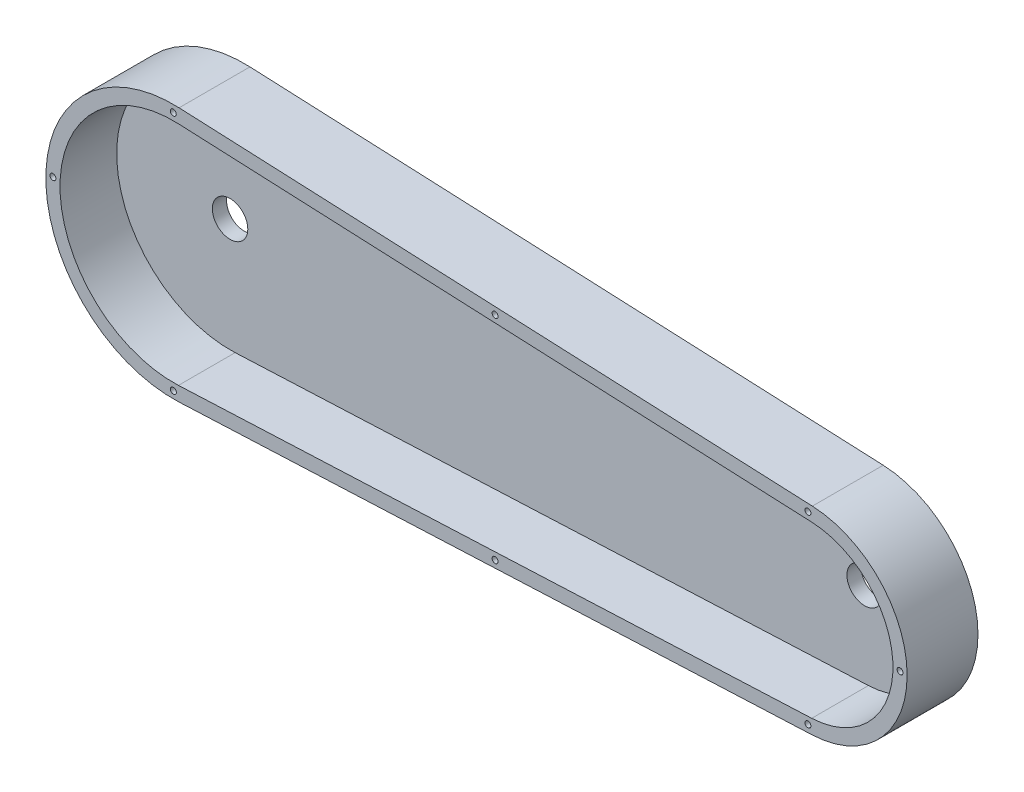
ISO-10303-21;
HEADER;
FILE_DESCRIPTION(('STEP AP214'),'2;1');
FILE_NAME('part.step','',(''),(''),'','','');
FILE_SCHEMA(('AUTOMOTIVE_DESIGN { 1 0 10303 214 1 1 1 1 }'));
ENDSEC;
DATA;
#1=APPLICATION_CONTEXT('core data for automotive mechanical design processes');
#2=APPLICATION_PROTOCOL_DEFINITION('international standard','automotive_design',2000,#1);
#3=PRODUCT_CONTEXT('',#1,'mechanical');
#4=PRODUCT('Part','Part','',(#3));
#5=PRODUCT_RELATED_PRODUCT_CATEGORY('part','',(#4));
#6=PRODUCT_DEFINITION_FORMATION('','',#4);
#7=PRODUCT_DEFINITION_CONTEXT('part definition',#1,'design');
#8=PRODUCT_DEFINITION('design','',#6,#7);
#9=PRODUCT_DEFINITION_SHAPE('','',#8);
#10=(LENGTH_UNIT() NAMED_UNIT(*) SI_UNIT(.MILLI.,.METRE.));
#11=(NAMED_UNIT(*) PLANE_ANGLE_UNIT() SI_UNIT($,.RADIAN.));
#12=(NAMED_UNIT(*) SI_UNIT($,.STERADIAN.) SOLID_ANGLE_UNIT());
#13=UNCERTAINTY_MEASURE_WITH_UNIT(LENGTH_MEASURE(1.E-05),#10,'distance_accuracy_value','');
#14=(GEOMETRIC_REPRESENTATION_CONTEXT(3) GLOBAL_UNCERTAINTY_ASSIGNED_CONTEXT((#13)) GLOBAL_UNIT_ASSIGNED_CONTEXT((#10,
#11,#12)) REPRESENTATION_CONTEXT('',''));
#15=CARTESIAN_POINT('',(0.,0.,0.));
#16=DIRECTION('',(0.,0.,1.));
#17=DIRECTION('',(1.,0.,0.));
#18=AXIS2_PLACEMENT_3D('',#15,#16,#17);
#19=CARTESIAN_POINT('',(-75.0216848949599,8.86394094338875E-12,0.));
#20=DIRECTION('',(0.,0.,1.));
#21=DIRECTION('',(1.,0.,0.));
#22=AXIS2_PLACEMENT_3D('',#19,#20,#21);
#23=PLANE('',#22);
#24=CARTESIAN_POINT('',(372.691743745799,8.89409608085559E-12,0.));
#25=DIRECTION('',(0.,0.,1.));
#26=DIRECTION('',(1.,0.,0.));
#27=AXIS2_PLACEMENT_3D('',#24,#25,#26);
#28=CIRCLE('',#27,12.5);
#29=CARTESIAN_POINT('',(385.191743745799,8.89409608085559E-12,0.));
#30=VERTEX_POINT('',#29);
#31=EDGE_CURVE('E231',#30,#30,#28,.T.);
#32=ORIENTED_EDGE('',*,*,#31,.T.);
#33=EDGE_LOOP('',(#32));
#34=FACE_BOUND('',#33,.T.);
#35=CARTESIAN_POINT('',(-75.0216848949599,8.86394094338875E-12,0.));
#36=DIRECTION('',(0.,0.,1.));
#37=DIRECTION('',(1.,0.,0.));
#38=AXIS2_PLACEMENT_3D('',#35,#36,#37);
#39=CIRCLE('',#38,12.5);
#40=CARTESIAN_POINT('',(-62.5216848949599,8.86394094338875E-12,0.));
#41=VERTEX_POINT('',#40);
#42=EDGE_CURVE('E237',#41,#41,#39,.T.);
#43=ORIENTED_EDGE('',*,*,#42,.T.);
#44=EDGE_LOOP('',(#43));
#45=FACE_BOUND('',#44,.T.);
#46=CARTESIAN_POINT('',(-75.0216848949599,8.86394094338875E-12,0.));
#47=DIRECTION('',(0.,0.,1.));
#48=DIRECTION('',(1.,0.,0.));
#49=AXIS2_PLACEMENT_3D('',#46,#47,#48);
#50=CIRCLE('',#49,90.);
#51=CARTESIAN_POINT('',(-71.0012560115451,89.9101559980573,0.));
#52=VERTEX_POINT('',#51);
#53=CARTESIAN_POINT('',(-71.0012560115451,-89.9101559980395,0.));
#54=VERTEX_POINT('',#53);
#55=EDGE_CURVE('E249',#52,#54,#50,.T.);
#56=ORIENTED_EDGE('',*,*,#55,.F.);
#57=DIRECTION('',(-0.999001733311649,0.0446714320379426,0.));
#58=VECTOR('',#57,1.);
#59=CARTESIAN_POINT('',(-71.0012560115451,89.9101559980573,0.));
#60=LINE('',#59,#58);
#61=CARTESIAN_POINT('',(375.818743988455,69.9301213318244,0.));
#62=VERTEX_POINT('',#61);
#63=EDGE_CURVE('E277',#62,#52,#60,.T.);
#64=ORIENTED_EDGE('',*,*,#63,.F.);
#65=CARTESIAN_POINT('',(372.691743745799,8.89409608085559E-12,0.));
#66=DIRECTION('',(0.,0.,1.));
#67=DIRECTION('',(-1.,0.,0.));
#68=AXIS2_PLACEMENT_3D('',#65,#66,#67);
#69=CIRCLE('',#68,70.);
#70=CARTESIAN_POINT('',(375.818743988455,-69.9301213318065,0.));
#71=VERTEX_POINT('',#70);
#72=EDGE_CURVE('E288',#71,#62,#69,.T.);
#73=ORIENTED_EDGE('',*,*,#72,.F.);
#74=DIRECTION('',(0.999001733311649,0.0446714320379428,0.));
#75=VECTOR('',#74,1.);
#76=CARTESIAN_POINT('',(-71.0012560115451,-89.9101559980395,0.));
#77=LINE('',#76,#75);
#78=EDGE_CURVE('E286',#54,#71,#77,.T.);
#79=ORIENTED_EDGE('',*,*,#78,.F.);
#80=EDGE_LOOP('',(#56,#64,#73,#79));
#81=FACE_BOUND('',#80,.T.);
#82=DIRECTION('',(-0.990466690426049,-0.137752441562642,0.));
#83=VECTOR('',#82,1.);
#84=CARTESIAN_POINT('',(93.540881228329,-30.0951416176447,0.));
#85=LINE('',#84,#83);
#86=CARTESIAN_POINT('',(291.634219313539,-2.54465330511627,0.));
#87=VERTEX_POINT('',#86);
#88=CARTESIAN_POINT('',(93.540881228329,-30.0951416176447,0.));
#89=VERTEX_POINT('',#88);
#90=EDGE_CURVE('E157',#87,#89,#85,.T.);
#91=ORIENTED_EDGE('',*,*,#90,.F.);
#92=DIRECTION('',(0.137752441562641,-0.990466690426049,0.));
#93=VECTOR('',#92,1.);
#94=CARTESIAN_POINT('',(291.634219313539,-2.54465330511627,0.));
#95=LINE('',#94,#93);
#96=CARTESIAN_POINT('',(288.879170482286,17.2646805034048,0.));
#97=VERTEX_POINT('',#96);
#98=EDGE_CURVE('E152',#97,#87,#95,.T.);
#99=ORIENTED_EDGE('',*,*,#98,.F.);
#100=DIRECTION('',(0.990466690426049,0.137752441562642,0.));
#101=VECTOR('',#100,1.);
#102=CARTESIAN_POINT('',(288.879170482286,17.2646805034048,0.));
#103=LINE('',#102,#101);
#104=CARTESIAN_POINT('',(90.7858323970762,-10.2858078091237,0.));
#105=VERTEX_POINT('',#104);
#106=EDGE_CURVE('E50',#105,#97,#103,.T.);
#107=ORIENTED_EDGE('',*,*,#106,.F.);
#108=DIRECTION('',(-0.137752441562642,0.990466690426049,0.));
#109=VECTOR('',#108,1.);
#110=CARTESIAN_POINT('',(90.7858323970762,-10.2858078091237,0.));
#111=LINE('',#110,#109);
#112=EDGE_CURVE('E45',#89,#105,#111,.T.);
#113=ORIENTED_EDGE('',*,*,#112,.F.);
#114=EDGE_LOOP('',(#91,#99,#107,#113));
#115=FACE_BOUND('',#114,.T.);
#116=ADVANCED_FACE('F30',(#34,#45,#81,#115),#23,.F.);
#117=CARTESIAN_POINT('',(-75.0216848949599,8.86394094338875E-12,50.));
#118=DIRECTION('',(0.,0.,-1.));
#119=DIRECTION('',(-1.,0.,0.));
#120=AXIS2_PLACEMENT_3D('',#117,#118,#119);
#121=CYLINDRICAL_SURFACE('',#120,90.);
#122=ORIENTED_EDGE('',*,*,#55,.T.);
#123=DIRECTION('',(0.,0.,-1.));
#124=VECTOR('',#123,1.);
#125=CARTESIAN_POINT('',(-71.0012560115451,-89.9101559980395,50.));
#126=LINE('',#125,#124);
#127=CARTESIAN_POINT('',(-71.0012560115451,-89.9101559980395,50.));
#128=VERTEX_POINT('',#127);
#129=EDGE_CURVE('E11',#128,#54,#126,.T.);
#130=ORIENTED_EDGE('',*,*,#129,.F.);
#131=CARTESIAN_POINT('',(-75.0216848949599,8.86394094338875E-12,50.));
#132=DIRECTION('',(0.,0.,1.));
#133=DIRECTION('',(1.,0.,0.));
#134=AXIS2_PLACEMENT_3D('',#131,#132,#133);
#135=CIRCLE('',#134,90.);
#136=CARTESIAN_POINT('',(-71.0012560115451,89.9101559980573,50.));
#137=VERTEX_POINT('',#136);
#138=EDGE_CURVE('E273',#137,#128,#135,.T.);
#139=ORIENTED_EDGE('',*,*,#138,.F.);
#140=DIRECTION('',(0.,0.,-1.));
#141=VECTOR('',#140,1.);
#142=CARTESIAN_POINT('',(-71.0012560115451,89.9101559980573,50.));
#143=LINE('',#142,#141);
#144=EDGE_CURVE('E283',#137,#52,#143,.T.);
#145=ORIENTED_EDGE('',*,*,#144,.T.);
#146=EDGE_LOOP('',(#122,#130,#139,#145));
#147=FACE_BOUND('',#146,.T.);
#148=ADVANCED_FACE('F32',(#147),#121,.T.);
#149=CARTESIAN_POINT('',(-71.0012560115451,-89.9101559980395,50.));
#150=DIRECTION('',(-0.0446714320379428,0.999001733311649,0.));
#151=DIRECTION('',(-0.999001733311649,-0.0446714320379428,0.));
#152=AXIS2_PLACEMENT_3D('',#149,#150,#151);
#153=PLANE('',#152);
#154=ORIENTED_EDGE('',*,*,#78,.T.);
#155=DIRECTION('',(0.,0.,-1.));
#156=VECTOR('',#155,1.);
#157=CARTESIAN_POINT('',(375.818743988455,-69.9301213318065,50.));
#158=LINE('',#157,#156);
#159=CARTESIAN_POINT('',(375.818743988455,-69.9301213318065,50.));
#160=VERTEX_POINT('',#159);
#161=EDGE_CURVE('E38',#160,#71,#158,.T.);
#162=ORIENTED_EDGE('',*,*,#161,.F.);
#163=DIRECTION('',(0.999001733311649,0.0446714320379428,0.));
#164=VECTOR('',#163,1.);
#165=CARTESIAN_POINT('',(-71.0012560115451,-89.9101559980395,50.));
#166=LINE('',#165,#164);
#167=EDGE_CURVE('E276',#128,#160,#166,.T.);
#168=ORIENTED_EDGE('',*,*,#167,.F.);
#169=ORIENTED_EDGE('',*,*,#129,.T.);
#170=EDGE_LOOP('',(#154,#162,#168,#169));
#171=FACE_BOUND('',#170,.T.);
#172=ADVANCED_FACE('F315',(#171),#153,.F.);
#173=CARTESIAN_POINT('',(372.691743745799,8.89409608085559E-12,50.));
#174=DIRECTION('',(0.,0.,-1.));
#175=DIRECTION('',(-1.,0.,0.));
#176=AXIS2_PLACEMENT_3D('',#173,#174,#175);
#177=CYLINDRICAL_SURFACE('',#176,70.);
#178=ORIENTED_EDGE('',*,*,#72,.T.);
#179=DIRECTION('',(0.,0.,-1.));
#180=VECTOR('',#179,1.);
#181=CARTESIAN_POINT('',(375.818743988455,69.9301213318244,50.));
#182=LINE('',#181,#180);
#183=CARTESIAN_POINT('',(375.818743988455,69.9301213318244,50.));
#184=VERTEX_POINT('',#183);
#185=EDGE_CURVE('E293',#184,#62,#182,.T.);
#186=ORIENTED_EDGE('',*,*,#185,.F.);
#187=CARTESIAN_POINT('',(372.691743745799,8.89409608085559E-12,50.));
#188=DIRECTION('',(0.,0.,1.));
#189=DIRECTION('',(-1.,0.,0.));
#190=AXIS2_PLACEMENT_3D('',#187,#188,#189);
#191=CIRCLE('',#190,70.);
#192=EDGE_CURVE('E279',#160,#184,#191,.T.);
#193=ORIENTED_EDGE('',*,*,#192,.F.);
#194=ORIENTED_EDGE('',*,*,#161,.T.);
#195=EDGE_LOOP('',(#178,#186,#193,#194));
#196=FACE_BOUND('',#195,.T.);
#197=ADVANCED_FACE('F300',(#196),#177,.T.);
#198=CARTESIAN_POINT('',(-71.0012560115451,89.9101559980573,50.));
#199=DIRECTION('',(-0.0446714320379426,-0.999001733311649,0.));
#200=DIRECTION('',(0.999001733311649,-0.0446714320379426,0.));
#201=AXIS2_PLACEMENT_3D('',#198,#199,#200);
#202=PLANE('',#201);
#203=ORIENTED_EDGE('',*,*,#63,.T.);
#204=ORIENTED_EDGE('',*,*,#144,.F.);
#205=DIRECTION('',(-0.999001733311649,0.0446714320379426,0.));
#206=VECTOR('',#205,1.);
#207=CARTESIAN_POINT('',(-71.0012560115451,89.9101559980573,50.));
#208=LINE('',#207,#206);
#209=EDGE_CURVE('E281',#184,#137,#208,.T.);
#210=ORIENTED_EDGE('',*,*,#209,.F.);
#211=ORIENTED_EDGE('',*,*,#185,.T.);
#212=EDGE_LOOP('',(#203,#204,#210,#211));
#213=FACE_BOUND('',#212,.T.);
#214=ADVANCED_FACE('F308',(#213),#202,.F.);
#215=CARTESIAN_POINT('',(-75.0216848949599,8.86394094338875E-12,50.));
#216=DIRECTION('',(0.,0.,1.));
#217=DIRECTION('',(1.,0.,0.));
#218=AXIS2_PLACEMENT_3D('',#215,#216,#217);
#219=PLANE('',#218);
#220=CARTESIAN_POINT('',(-160.02168489496,3.13392953217186,50.));
#221=DIRECTION('',(0.,0.,1.));
#222=DIRECTION('',(1.,0.,0.));
#223=AXIS2_PLACEMENT_3D('',#220,#221,#222);
#224=CIRCLE('',#223,2.09999999999999);
#225=CARTESIAN_POINT('',(-157.92168489496,3.13392953217186,50.));
#226=VERTEX_POINT('',#225);
#227=EDGE_CURVE('E159',#226,#226,#224,.T.);
#228=ORIENTED_EDGE('',*,*,#227,.F.);
#229=EDGE_LOOP('',(#228));
#230=FACE_BOUND('',#229,.T.);
#231=CARTESIAN_POINT('',(-75.0813425323133,85.,50.));
#232=DIRECTION('',(0.,0.,1.));
#233=DIRECTION('',(1.,0.,0.));
#234=AXIS2_PLACEMENT_3D('',#231,#232,#233);
#235=CIRCLE('',#234,2.09999999999999);
#236=CARTESIAN_POINT('',(-72.9813425323133,85.,50.));
#237=VERTEX_POINT('',#236);
#238=EDGE_CURVE('E188',#237,#237,#235,.T.);
#239=ORIENTED_EDGE('',*,*,#238,.F.);
#240=EDGE_LOOP('',(#239));
#241=FACE_BOUND('',#240,.T.);
#242=CARTESIAN_POINT('',(-75.0216848949599,-84.9999999999911,50.));
#243=DIRECTION('',(0.,0.,1.));
#244=DIRECTION('',(1.,0.,0.));
#245=AXIS2_PLACEMENT_3D('',#242,#243,#244);
#246=CIRCLE('',#245,2.09999999999999);
#247=CARTESIAN_POINT('',(-72.9216848949599,-84.9999999999911,50.));
#248=VERTEX_POINT('',#247);
#249=EDGE_CURVE('E194',#248,#248,#246,.T.);
#250=ORIENTED_EDGE('',*,*,#249,.F.);
#251=EDGE_LOOP('',(#250));
#252=FACE_BOUND('',#251,.T.);
#253=CARTESIAN_POINT('',(437.691743745799,0.,50.));
#254=DIRECTION('',(0.,0.,1.));
#255=DIRECTION('',(1.,0.,0.));
#256=AXIS2_PLACEMENT_3D('',#253,#254,#255);
#257=CIRCLE('',#256,2.09999999999999);
#258=CARTESIAN_POINT('',(439.791743745799,0.,50.));
#259=VERTEX_POINT('',#258);
#260=EDGE_CURVE('E200',#259,#259,#257,.T.);
#261=ORIENTED_EDGE('',*,*,#260,.F.);
#262=EDGE_LOOP('',(#261));
#263=FACE_BOUND('',#262,.T.);
#264=CARTESIAN_POINT('',(372.686127316462,-64.9999997573428,50.));
#265=DIRECTION('',(0.,0.,1.));
#266=DIRECTION('',(1.,0.,0.));
#267=AXIS2_PLACEMENT_3D('',#264,#265,#266);
#268=CIRCLE('',#267,2.09999999999999);
#269=CARTESIAN_POINT('',(374.786127316462,-64.9999997573428,50.));
#270=VERTEX_POINT('',#269);
#271=EDGE_CURVE('E206',#270,#270,#268,.T.);
#272=ORIENTED_EDGE('',*,*,#271,.F.);
#273=EDGE_LOOP('',(#272));
#274=FACE_BOUND('',#273,.T.);
#275=CARTESIAN_POINT('',(372.691743745799,65.0000000000089,50.));
#276=DIRECTION('',(0.,0.,1.));
#277=DIRECTION('',(1.,0.,0.));
#278=AXIS2_PLACEMENT_3D('',#275,#276,#277);
#279=CIRCLE('',#278,2.09999999999999);
#280=CARTESIAN_POINT('',(374.791743745799,65.0000000000089,50.));
#281=VERTEX_POINT('',#280);
#282=EDGE_CURVE('E212',#281,#281,#279,.T.);
#283=ORIENTED_EDGE('',*,*,#282,.F.);
#284=EDGE_LOOP('',(#283));
#285=FACE_BOUND('',#284,.T.);
#286=CARTESIAN_POINT('',(151.962029668076,74.9201386649408,50.));
#287=DIRECTION('',(0.,0.,1.));
#288=DIRECTION('',(1.,0.,0.));
#289=AXIS2_PLACEMENT_3D('',#286,#287,#288);
#290=CIRCLE('',#289,2.09999999999999);
#291=CARTESIAN_POINT('',(154.062029668075,74.9201386649408,50.));
#292=VERTEX_POINT('',#291);
#293=EDGE_CURVE('E218',#292,#292,#290,.T.);
#294=ORIENTED_EDGE('',*,*,#293,.F.);
#295=EDGE_LOOP('',(#294));
#296=FACE_BOUND('',#295,.T.);
#297=CARTESIAN_POINT('',(151.962918885981,-74.9400543304962,50.));
#298=DIRECTION('',(0.,0.,1.));
#299=DIRECTION('',(1.,0.,0.));
#300=AXIS2_PLACEMENT_3D('',#297,#298,#299);
#301=CIRCLE('',#300,2.09999999999999);
#302=CARTESIAN_POINT('',(154.062918885981,-74.9400543304962,50.));
#303=VERTEX_POINT('',#302);
#304=EDGE_CURVE('E224',#303,#303,#301,.T.);
#305=ORIENTED_EDGE('',*,*,#304,.F.);
#306=EDGE_LOOP('',(#305));
#307=FACE_BOUND('',#306,.T.);
#308=CARTESIAN_POINT('',(-75.0216848949599,8.86394094338875E-12,50.));
#309=DIRECTION('',(0.,0.,1.));
#310=DIRECTION('',(1.,0.,0.));
#311=AXIS2_PLACEMENT_3D('',#308,#309,#310);
#312=CIRCLE('',#311,80.);
#313=CARTESIAN_POINT('',(-71.4479703319245,79.9201386649408,50.));
#314=VERTEX_POINT('',#313);
#315=CARTESIAN_POINT('',(-71.4479703319245,-79.920138664923,50.));
#316=VERTEX_POINT('',#315);
#317=EDGE_CURVE('E265',#314,#316,#312,.T.);
#318=ORIENTED_EDGE('',*,*,#317,.F.);
#319=DIRECTION('',(-0.999001733311649,0.0446714320379426,0.));
#320=VECTOR('',#319,1.);
#321=CARTESIAN_POINT('',(-71.4479703319245,79.9201386649408,50.));
#322=LINE('',#321,#320);
#323=CARTESIAN_POINT('',(375.372029668076,59.9401039987079,50.));
#324=VERTEX_POINT('',#323);
#325=EDGE_CURVE('E255',#324,#314,#322,.T.);
#326=ORIENTED_EDGE('',*,*,#325,.F.);
#327=CARTESIAN_POINT('',(372.691743745799,8.89409608085559E-12,50.));
#328=DIRECTION('',(0.,0.,1.));
#329=DIRECTION('',(1.,0.,0.));
#330=AXIS2_PLACEMENT_3D('',#327,#328,#329);
#331=CIRCLE('',#330,60.);
#332=CARTESIAN_POINT('',(375.372029668076,-59.94010399869,50.));
#333=VERTEX_POINT('',#332);
#334=EDGE_CURVE('E269',#333,#324,#331,.T.);
#335=ORIENTED_EDGE('',*,*,#334,.F.);
#336=DIRECTION('',(0.999001733311649,0.0446714320379428,0.));
#337=VECTOR('',#336,1.);
#338=CARTESIAN_POINT('',(-71.4479703319245,-79.920138664923,50.));
#339=LINE('',#338,#337);
#340=EDGE_CURVE('E267',#316,#333,#339,.T.);
#341=ORIENTED_EDGE('',*,*,#340,.F.);
#342=EDGE_LOOP('',(#318,#326,#335,#341));
#343=FACE_BOUND('',#342,.T.);
#344=ORIENTED_EDGE('',*,*,#138,.T.);
#345=ORIENTED_EDGE('',*,*,#167,.T.);
#346=ORIENTED_EDGE('',*,*,#192,.T.);
#347=ORIENTED_EDGE('',*,*,#209,.T.);
#348=EDGE_LOOP('',(#344,#345,#346,#347));
#349=FACE_BOUND('',#348,.T.);
#350=ADVANCED_FACE('F314',(#230,#241,#252,#263,#274,#285,#296,#307,#343,#349),#219,.T.);
#351=CARTESIAN_POINT('',(-75.0216848949599,8.86394094338875E-12,50.));
#352=DIRECTION('',(0.,0.,-1.));
#353=DIRECTION('',(-1.,0.,0.));
#354=AXIS2_PLACEMENT_3D('',#351,#352,#353);
#355=CYLINDRICAL_SURFACE('',#354,80.);
#356=CARTESIAN_POINT('',(-75.0216848949599,8.86394094338875E-12,10.));
#357=DIRECTION('',(0.,0.,1.));
#358=DIRECTION('',(1.,0.,0.));
#359=AXIS2_PLACEMENT_3D('',#356,#357,#358);
#360=CIRCLE('',#359,80.);
#361=CARTESIAN_POINT('',(-71.4479703319245,79.9201386649408,10.));
#362=VERTEX_POINT('',#361);
#363=CARTESIAN_POINT('',(-71.4479703319245,-79.920138664923,10.));
#364=VERTEX_POINT('',#363);
#365=EDGE_CURVE('E240',#362,#364,#360,.T.);
#366=ORIENTED_EDGE('',*,*,#365,.F.);
#367=DIRECTION('',(0.,0.,-1.));
#368=VECTOR('',#367,1.);
#369=CARTESIAN_POINT('',(-71.4479703319245,79.9201386649408,50.));
#370=LINE('',#369,#368);
#371=EDGE_CURVE('E251',#314,#362,#370,.T.);
#372=ORIENTED_EDGE('',*,*,#371,.F.);
#373=ORIENTED_EDGE('',*,*,#317,.T.);
#374=DIRECTION('',(0.,0.,1.));
#375=VECTOR('',#374,1.);
#376=CARTESIAN_POINT('',(-71.4479703319245,-79.920138664923,50.));
#377=LINE('',#376,#375);
#378=EDGE_CURVE('E246',#316,#364,#377,.F.);
#379=ORIENTED_EDGE('',*,*,#378,.T.);
#380=EDGE_LOOP('',(#366,#372,#373,#379));
#381=FACE_BOUND('',#380,.T.);
#382=ADVANCED_FACE('F466',(#381),#355,.F.);
#383=CARTESIAN_POINT('',(-71.4479703319245,-79.920138664923,50.));
#384=DIRECTION('',(-0.0446714320379428,0.999001733311649,0.));
#385=DIRECTION('',(-0.999001733311649,-0.0446714320379428,0.));
#386=AXIS2_PLACEMENT_3D('',#383,#384,#385);
#387=PLANE('',#386);
#388=DIRECTION('',(0.999001733311649,0.0446714320379428,0.));
#389=VECTOR('',#388,1.);
#390=CARTESIAN_POINT('',(-71.4479703319245,-79.920138664923,10.));
#391=LINE('',#390,#389);
#392=CARTESIAN_POINT('',(375.372029668076,-59.9401039986901,10.));
#393=VERTEX_POINT('',#392);
#394=EDGE_CURVE('E245',#364,#393,#391,.T.);
#395=ORIENTED_EDGE('',*,*,#394,.F.);
#396=ORIENTED_EDGE('',*,*,#378,.F.);
#397=ORIENTED_EDGE('',*,*,#340,.T.);
#398=DIRECTION('',(0.,0.,-1.));
#399=VECTOR('',#398,1.);
#400=CARTESIAN_POINT('',(375.372029668076,-59.9401039986901,50.));
#401=LINE('',#400,#399);
#402=EDGE_CURVE('E250',#333,#393,#401,.T.);
#403=ORIENTED_EDGE('',*,*,#402,.T.);
#404=EDGE_LOOP('',(#395,#396,#397,#403));
#405=FACE_BOUND('',#404,.T.);
#406=ADVANCED_FACE('F469',(#405),#387,.T.);
#407=CARTESIAN_POINT('',(372.691743745799,8.89409608085559E-12,50.));
#408=DIRECTION('',(0.,0.,-1.));
#409=DIRECTION('',(-1.,0.,0.));
#410=AXIS2_PLACEMENT_3D('',#407,#408,#409);
#411=CYLINDRICAL_SURFACE('',#410,60.);
#412=CARTESIAN_POINT('',(372.691743745799,8.89409608085559E-12,10.));
#413=DIRECTION('',(0.,0.,1.));
#414=DIRECTION('',(1.,0.,0.));
#415=AXIS2_PLACEMENT_3D('',#412,#413,#414);
#416=CIRCLE('',#415,60.);
#417=CARTESIAN_POINT('',(375.372029668076,59.9401039987079,10.));
#418=VERTEX_POINT('',#417);
#419=EDGE_CURVE('E257',#393,#418,#416,.T.);
#420=ORIENTED_EDGE('',*,*,#419,.F.);
#421=ORIENTED_EDGE('',*,*,#402,.F.);
#422=ORIENTED_EDGE('',*,*,#334,.T.);
#423=DIRECTION('',(0.,0.,1.));
#424=VECTOR('',#423,1.);
#425=CARTESIAN_POINT('',(375.372029668076,59.9401039987079,50.));
#426=LINE('',#425,#424);
#427=EDGE_CURVE('E254',#324,#418,#426,.F.);
#428=ORIENTED_EDGE('',*,*,#427,.T.);
#429=EDGE_LOOP('',(#420,#421,#422,#428));
#430=FACE_BOUND('',#429,.T.);
#431=ADVANCED_FACE('F473',(#430),#411,.F.);
#432=CARTESIAN_POINT('',(-71.4479703319245,79.9201386649408,50.));
#433=DIRECTION('',(-0.0446714320379426,-0.999001733311649,0.));
#434=DIRECTION('',(0.999001733311649,-0.0446714320379426,0.));
#435=AXIS2_PLACEMENT_3D('',#432,#433,#434);
#436=PLANE('',#435);
#437=DIRECTION('',(-0.999001733311649,0.0446714320379426,0.));
#438=VECTOR('',#437,1.);
#439=CARTESIAN_POINT('',(-71.4479703319245,79.9201386649408,10.));
#440=LINE('',#439,#438);
#441=EDGE_CURVE('E261',#418,#362,#440,.T.);
#442=ORIENTED_EDGE('',*,*,#441,.F.);
#443=ORIENTED_EDGE('',*,*,#427,.F.);
#444=ORIENTED_EDGE('',*,*,#325,.T.);
#445=ORIENTED_EDGE('',*,*,#371,.T.);
#446=EDGE_LOOP('',(#442,#443,#444,#445));
#447=FACE_BOUND('',#446,.T.);
#448=ADVANCED_FACE('F477',(#447),#436,.T.);
#449=CARTESIAN_POINT('',(-75.0216848949599,8.86394094338875E-12,10.));
#450=DIRECTION('',(0.,0.,1.));
#451=DIRECTION('',(1.,0.,0.));
#452=AXIS2_PLACEMENT_3D('',#449,#450,#451);
#453=PLANE('',#452);
#454=CARTESIAN_POINT('',(372.691743745799,8.89409608085559E-12,10.));
#455=DIRECTION('',(0.,0.,1.));
#456=DIRECTION('',(1.,0.,0.));
#457=AXIS2_PLACEMENT_3D('',#454,#455,#456);
#458=CIRCLE('',#457,12.5);
#459=CARTESIAN_POINT('',(385.191743745799,8.89409608085559E-12,10.));
#460=VERTEX_POINT('',#459);
#461=EDGE_CURVE('E230',#460,#460,#458,.T.);
#462=ORIENTED_EDGE('',*,*,#461,.F.);
#463=EDGE_LOOP('',(#462));
#464=FACE_BOUND('',#463,.T.);
#465=CARTESIAN_POINT('',(-75.0216848949599,8.86394094338875E-12,10.));
#466=DIRECTION('',(0.,0.,1.));
#467=DIRECTION('',(1.,0.,0.));
#468=AXIS2_PLACEMENT_3D('',#465,#466,#467);
#469=CIRCLE('',#468,12.5);
#470=CARTESIAN_POINT('',(-62.5216848949599,8.86394094338875E-12,10.));
#471=VERTEX_POINT('',#470);
#472=EDGE_CURVE('E234',#471,#471,#469,.T.);
#473=ORIENTED_EDGE('',*,*,#472,.F.);
#474=EDGE_LOOP('',(#473));
#475=FACE_BOUND('',#474,.T.);
#476=ORIENTED_EDGE('',*,*,#365,.T.);
#477=ORIENTED_EDGE('',*,*,#394,.T.);
#478=ORIENTED_EDGE('',*,*,#419,.T.);
#479=ORIENTED_EDGE('',*,*,#441,.T.);
#480=EDGE_LOOP('',(#476,#477,#478,#479));
#481=FACE_BOUND('',#480,.T.);
#482=ADVANCED_FACE('F464',(#464,#475,#481),#453,.T.);
#483=CARTESIAN_POINT('',(-75.0216848949599,8.86394094338875E-12,0.));
#484=DIRECTION('',(0.,0.,1.));
#485=DIRECTION('',(1.,0.,0.));
#486=AXIS2_PLACEMENT_3D('',#483,#484,#485);
#487=CYLINDRICAL_SURFACE('',#486,12.5);
#488=ORIENTED_EDGE('',*,*,#42,.F.);
#489=EDGE_LOOP('',(#488));
#490=FACE_BOUND('',#489,.T.);
#491=ORIENTED_EDGE('',*,*,#472,.T.);
#492=EDGE_LOOP('',(#491));
#493=FACE_BOUND('',#492,.T.);
#494=ADVANCED_FACE('F460',(#490,#493),#487,.F.);
#495=CARTESIAN_POINT('',(372.691743745799,8.89409608085559E-12,0.));
#496=DIRECTION('',(0.,0.,1.));
#497=DIRECTION('',(1.,0.,0.));
#498=AXIS2_PLACEMENT_3D('',#495,#496,#497);
#499=CYLINDRICAL_SURFACE('',#498,12.5);
#500=ORIENTED_EDGE('',*,*,#31,.F.);
#501=EDGE_LOOP('',(#500));
#502=FACE_BOUND('',#501,.T.);
#503=ORIENTED_EDGE('',*,*,#461,.T.);
#504=EDGE_LOOP('',(#503));
#505=FACE_BOUND('',#504,.T.);
#506=ADVANCED_FACE('F456',(#502,#505),#499,.F.);
#507=CARTESIAN_POINT('',(151.962918885981,-74.9400543304962,40.));
#508=DIRECTION('',(0.,0.,1.));
#509=DIRECTION('',(1.,0.,0.));
#510=AXIS2_PLACEMENT_3D('',#507,#508,#509);
#511=CONICAL_SURFACE('',#510,2.09999999999999,1.02974425867665);
#512=CARTESIAN_POINT('',(151.962918885981,-74.9400543304962,38.7381927000421));
#513=VERTEX_POINT('',#512);
#514=VERTEX_LOOP('',#513);
#515=FACE_BOUND('',#514,.T.);
#516=CARTESIAN_POINT('',(151.962918885981,-74.9400543304962,40.));
#517=DIRECTION('',(0.,0.,1.));
#518=DIRECTION('',(1.,0.,0.));
#519=AXIS2_PLACEMENT_3D('',#516,#517,#518);
#520=CIRCLE('',#519,2.09999999999999);
#521=CARTESIAN_POINT('',(154.062918885981,-74.9400543304962,40.));
#522=VERTEX_POINT('',#521);
#523=EDGE_CURVE('E227',#522,#522,#520,.T.);
#524=ORIENTED_EDGE('',*,*,#523,.T.);
#525=EDGE_LOOP('',(#524));
#526=FACE_BOUND('',#525,.T.);
#527=ADVANCED_FACE('F452',(#515,#526),#511,.F.);
#528=CARTESIAN_POINT('',(151.962918885981,-74.9400543304962,50.));
#529=DIRECTION('',(0.,0.,1.));
#530=DIRECTION('',(1.,0.,0.));
#531=AXIS2_PLACEMENT_3D('',#528,#529,#530);
#532=CYLINDRICAL_SURFACE('',#531,2.09999999999999);
#533=ORIENTED_EDGE('',*,*,#523,.F.);
#534=EDGE_LOOP('',(#533));
#535=FACE_BOUND('',#534,.T.);
#536=ORIENTED_EDGE('',*,*,#304,.T.);
#537=EDGE_LOOP('',(#536));
#538=FACE_BOUND('',#537,.T.);
#539=ADVANCED_FACE('F448',(#535,#538),#532,.F.);
#540=CARTESIAN_POINT('',(151.962029668076,74.9201386649408,40.));
#541=DIRECTION('',(0.,0.,1.));
#542=DIRECTION('',(1.,0.,0.));
#543=AXIS2_PLACEMENT_3D('',#540,#541,#542);
#544=CONICAL_SURFACE('',#543,2.09999999999999,1.02974425867665);
#545=CARTESIAN_POINT('',(151.962029668076,74.9201386649408,38.7381927000421));
#546=VERTEX_POINT('',#545);
#547=VERTEX_LOOP('',#546);
#548=FACE_BOUND('',#547,.T.);
#549=CARTESIAN_POINT('',(151.962029668076,74.9201386649408,40.));
#550=DIRECTION('',(0.,0.,1.));
#551=DIRECTION('',(1.,0.,0.));
#552=AXIS2_PLACEMENT_3D('',#549,#550,#551);
#553=CIRCLE('',#552,2.09999999999999);
#554=CARTESIAN_POINT('',(154.062029668075,74.9201386649408,40.));
#555=VERTEX_POINT('',#554);
#556=EDGE_CURVE('E221',#555,#555,#553,.T.);
#557=ORIENTED_EDGE('',*,*,#556,.T.);
#558=EDGE_LOOP('',(#557));
#559=FACE_BOUND('',#558,.T.);
#560=ADVANCED_FACE('F444',(#548,#559),#544,.F.);
#561=CARTESIAN_POINT('',(151.962029668076,74.9201386649408,50.));
#562=DIRECTION('',(0.,0.,1.));
#563=DIRECTION('',(1.,0.,0.));
#564=AXIS2_PLACEMENT_3D('',#561,#562,#563);
#565=CYLINDRICAL_SURFACE('',#564,2.09999999999999);
#566=ORIENTED_EDGE('',*,*,#556,.F.);
#567=EDGE_LOOP('',(#566));
#568=FACE_BOUND('',#567,.T.);
#569=ORIENTED_EDGE('',*,*,#293,.T.);
#570=EDGE_LOOP('',(#569));
#571=FACE_BOUND('',#570,.T.);
#572=ADVANCED_FACE('F440',(#568,#571),#565,.F.);
#573=CARTESIAN_POINT('',(372.691743745799,65.0000000000089,40.));
#574=DIRECTION('',(0.,0.,1.));
#575=DIRECTION('',(1.,0.,0.));
#576=AXIS2_PLACEMENT_3D('',#573,#574,#575);
#577=CONICAL_SURFACE('',#576,2.09999999999999,1.02974425867665);
#578=CARTESIAN_POINT('',(372.691743745799,65.0000000000089,38.7381927000421));
#579=VERTEX_POINT('',#578);
#580=VERTEX_LOOP('',#579);
#581=FACE_BOUND('',#580,.T.);
#582=CARTESIAN_POINT('',(372.691743745799,65.0000000000089,40.));
#583=DIRECTION('',(0.,0.,1.));
#584=DIRECTION('',(1.,0.,0.));
#585=AXIS2_PLACEMENT_3D('',#582,#583,#584);
#586=CIRCLE('',#585,2.09999999999999);
#587=CARTESIAN_POINT('',(374.791743745799,65.0000000000089,40.));
#588=VERTEX_POINT('',#587);
#589=EDGE_CURVE('E215',#588,#588,#586,.T.);
#590=ORIENTED_EDGE('',*,*,#589,.T.);
#591=EDGE_LOOP('',(#590));
#592=FACE_BOUND('',#591,.T.);
#593=ADVANCED_FACE('F436',(#581,#592),#577,.F.);
#594=CARTESIAN_POINT('',(372.691743745799,65.0000000000089,50.));
#595=DIRECTION('',(0.,0.,1.));
#596=DIRECTION('',(1.,0.,0.));
#597=AXIS2_PLACEMENT_3D('',#594,#595,#596);
#598=CYLINDRICAL_SURFACE('',#597,2.09999999999999);
#599=ORIENTED_EDGE('',*,*,#589,.F.);
#600=EDGE_LOOP('',(#599));
#601=FACE_BOUND('',#600,.T.);
#602=ORIENTED_EDGE('',*,*,#282,.T.);
#603=EDGE_LOOP('',(#602));
#604=FACE_BOUND('',#603,.T.);
#605=ADVANCED_FACE('F432',(#601,#604),#598,.F.);
#606=CARTESIAN_POINT('',(372.686127316462,-64.9999997573428,40.));
#607=DIRECTION('',(0.,0.,1.));
#608=DIRECTION('',(1.,0.,0.));
#609=AXIS2_PLACEMENT_3D('',#606,#607,#608);
#610=CONICAL_SURFACE('',#609,2.09999999999999,1.02974425867665);
#611=CARTESIAN_POINT('',(372.686127316462,-64.9999997573428,38.7381927000421));
#612=VERTEX_POINT('',#611);
#613=VERTEX_LOOP('',#612);
#614=FACE_BOUND('',#613,.T.);
#615=CARTESIAN_POINT('',(372.686127316462,-64.9999997573428,40.));
#616=DIRECTION('',(0.,0.,1.));
#617=DIRECTION('',(1.,0.,0.));
#618=AXIS2_PLACEMENT_3D('',#615,#616,#617);
#619=CIRCLE('',#618,2.09999999999999);
#620=CARTESIAN_POINT('',(374.786127316462,-64.9999997573428,40.));
#621=VERTEX_POINT('',#620);
#622=EDGE_CURVE('E209',#621,#621,#619,.T.);
#623=ORIENTED_EDGE('',*,*,#622,.T.);
#624=EDGE_LOOP('',(#623));
#625=FACE_BOUND('',#624,.T.);
#626=ADVANCED_FACE('F428',(#614,#625),#610,.F.);
#627=CARTESIAN_POINT('',(372.686127316462,-64.9999997573428,50.));
#628=DIRECTION('',(0.,0.,1.));
#629=DIRECTION('',(1.,0.,0.));
#630=AXIS2_PLACEMENT_3D('',#627,#628,#629);
#631=CYLINDRICAL_SURFACE('',#630,2.09999999999999);
#632=ORIENTED_EDGE('',*,*,#622,.F.);
#633=EDGE_LOOP('',(#632));
#634=FACE_BOUND('',#633,.T.);
#635=ORIENTED_EDGE('',*,*,#271,.T.);
#636=EDGE_LOOP('',(#635));
#637=FACE_BOUND('',#636,.T.);
#638=ADVANCED_FACE('F424',(#634,#637),#631,.F.);
#639=CARTESIAN_POINT('',(437.691743745799,0.,40.));
#640=DIRECTION('',(0.,0.,1.));
#641=DIRECTION('',(1.,0.,0.));
#642=AXIS2_PLACEMENT_3D('',#639,#640,#641);
#643=CONICAL_SURFACE('',#642,2.09999999999999,1.02974425867665);
#644=CARTESIAN_POINT('',(437.691743745799,0.,38.7381927000421));
#645=VERTEX_POINT('',#644);
#646=VERTEX_LOOP('',#645);
#647=FACE_BOUND('',#646,.T.);
#648=CARTESIAN_POINT('',(437.691743745799,0.,40.));
#649=DIRECTION('',(0.,0.,1.));
#650=DIRECTION('',(1.,0.,0.));
#651=AXIS2_PLACEMENT_3D('',#648,#649,#650);
#652=CIRCLE('',#651,2.09999999999999);
#653=CARTESIAN_POINT('',(439.791743745799,0.,40.));
#654=VERTEX_POINT('',#653);
#655=EDGE_CURVE('E203',#654,#654,#652,.T.);
#656=ORIENTED_EDGE('',*,*,#655,.T.);
#657=EDGE_LOOP('',(#656));
#658=FACE_BOUND('',#657,.T.);
#659=ADVANCED_FACE('F420',(#647,#658),#643,.F.);
#660=CARTESIAN_POINT('',(437.691743745799,0.,50.));
#661=DIRECTION('',(0.,0.,1.));
#662=DIRECTION('',(1.,0.,0.));
#663=AXIS2_PLACEMENT_3D('',#660,#661,#662);
#664=CYLINDRICAL_SURFACE('',#663,2.09999999999999);
#665=ORIENTED_EDGE('',*,*,#655,.F.);
#666=EDGE_LOOP('',(#665));
#667=FACE_BOUND('',#666,.T.);
#668=ORIENTED_EDGE('',*,*,#260,.T.);
#669=EDGE_LOOP('',(#668));
#670=FACE_BOUND('',#669,.T.);
#671=ADVANCED_FACE('F416',(#667,#670),#664,.F.);
#672=CARTESIAN_POINT('',(-75.0216848949599,-84.9999999999911,40.));
#673=DIRECTION('',(0.,0.,1.));
#674=DIRECTION('',(1.,0.,0.));
#675=AXIS2_PLACEMENT_3D('',#672,#673,#674);
#676=CONICAL_SURFACE('',#675,2.1,1.02974425867666);
#677=CARTESIAN_POINT('',(-75.0216848949599,-84.9999999999911,38.7381927000421));
#678=VERTEX_POINT('',#677);
#679=VERTEX_LOOP('',#678);
#680=FACE_BOUND('',#679,.T.);
#681=CARTESIAN_POINT('',(-75.0216848949599,-84.9999999999911,40.));
#682=DIRECTION('',(0.,0.,1.));
#683=DIRECTION('',(1.,0.,0.));
#684=AXIS2_PLACEMENT_3D('',#681,#682,#683);
#685=CIRCLE('',#684,2.1);
#686=CARTESIAN_POINT('',(-72.9216848949599,-84.9999999999911,40.));
#687=VERTEX_POINT('',#686);
#688=EDGE_CURVE('E197',#687,#687,#685,.T.);
#689=ORIENTED_EDGE('',*,*,#688,.T.);
#690=EDGE_LOOP('',(#689));
#691=FACE_BOUND('',#690,.T.);
#692=ADVANCED_FACE('F412',(#680,#691),#676,.F.);
#693=CARTESIAN_POINT('',(-75.0216848949599,-84.9999999999911,50.));
#694=DIRECTION('',(0.,0.,1.));
#695=DIRECTION('',(1.,0.,0.));
#696=AXIS2_PLACEMENT_3D('',#693,#694,#695);
#697=CYLINDRICAL_SURFACE('',#696,2.1);
#698=ORIENTED_EDGE('',*,*,#688,.F.);
#699=EDGE_LOOP('',(#698));
#700=FACE_BOUND('',#699,.T.);
#701=ORIENTED_EDGE('',*,*,#249,.T.);
#702=EDGE_LOOP('',(#701));
#703=FACE_BOUND('',#702,.T.);
#704=ADVANCED_FACE('F408',(#700,#703),#697,.F.);
#705=CARTESIAN_POINT('',(-75.0813425323133,85.,40.));
#706=DIRECTION('',(0.,0.,1.));
#707=DIRECTION('',(1.,0.,0.));
#708=AXIS2_PLACEMENT_3D('',#705,#706,#707);
#709=CONICAL_SURFACE('',#708,2.09999999999999,1.02974425867665);
#710=CARTESIAN_POINT('',(-75.0813425323133,85.,38.7381927000421));
#711=VERTEX_POINT('',#710);
#712=VERTEX_LOOP('',#711);
#713=FACE_BOUND('',#712,.T.);
#714=CARTESIAN_POINT('',(-75.0813425323133,85.,40.));
#715=DIRECTION('',(0.,0.,1.));
#716=DIRECTION('',(1.,0.,0.));
#717=AXIS2_PLACEMENT_3D('',#714,#715,#716);
#718=CIRCLE('',#717,2.09999999999999);
#719=CARTESIAN_POINT('',(-72.9813425323133,85.,40.));
#720=VERTEX_POINT('',#719);
#721=EDGE_CURVE('E191',#720,#720,#718,.T.);
#722=ORIENTED_EDGE('',*,*,#721,.T.);
#723=EDGE_LOOP('',(#722));
#724=FACE_BOUND('',#723,.T.);
#725=ADVANCED_FACE('F404',(#713,#724),#709,.F.);
#726=CARTESIAN_POINT('',(-75.0813425323133,85.,50.));
#727=DIRECTION('',(0.,0.,1.));
#728=DIRECTION('',(1.,0.,0.));
#729=AXIS2_PLACEMENT_3D('',#726,#727,#728);
#730=CYLINDRICAL_SURFACE('',#729,2.09999999999999);
#731=ORIENTED_EDGE('',*,*,#721,.F.);
#732=EDGE_LOOP('',(#731));
#733=FACE_BOUND('',#732,.T.);
#734=ORIENTED_EDGE('',*,*,#238,.T.);
#735=EDGE_LOOP('',(#734));
#736=FACE_BOUND('',#735,.T.);
#737=ADVANCED_FACE('F400',(#733,#736),#730,.F.);
#738=CARTESIAN_POINT('',(-160.02168489496,3.13392953217186,40.));
#739=DIRECTION('',(0.,0.,1.));
#740=DIRECTION('',(1.,0.,0.));
#741=AXIS2_PLACEMENT_3D('',#738,#739,#740);
#742=CONICAL_SURFACE('',#741,2.09999999999999,1.02974425867665);
#743=CARTESIAN_POINT('',(-160.02168489496,3.13392953217186,38.7381927000421));
#744=VERTEX_POINT('',#743);
#745=VERTEX_LOOP('',#744);
#746=FACE_BOUND('',#745,.T.);
#747=CARTESIAN_POINT('',(-160.02168489496,3.13392953217186,40.));
#748=DIRECTION('',(0.,0.,1.));
#749=DIRECTION('',(1.,0.,0.));
#750=AXIS2_PLACEMENT_3D('',#747,#748,#749);
#751=CIRCLE('',#750,2.09999999999999);
#752=CARTESIAN_POINT('',(-157.92168489496,3.13392953217186,40.));
#753=VERTEX_POINT('',#752);
#754=EDGE_CURVE('E185',#753,#753,#751,.T.);
#755=ORIENTED_EDGE('',*,*,#754,.T.);
#756=EDGE_LOOP('',(#755));
#757=FACE_BOUND('',#756,.T.);
#758=ADVANCED_FACE('F396',(#746,#757),#742,.F.);
#759=CARTESIAN_POINT('',(-160.02168489496,3.13392953217186,50.));
#760=DIRECTION('',(0.,0.,1.));
#761=DIRECTION('',(1.,0.,0.));
#762=AXIS2_PLACEMENT_3D('',#759,#760,#761);
#763=CYLINDRICAL_SURFACE('',#762,2.09999999999999);
#764=ORIENTED_EDGE('',*,*,#754,.F.);
#765=EDGE_LOOP('',(#764));
#766=FACE_BOUND('',#765,.T.);
#767=ORIENTED_EDGE('',*,*,#227,.T.);
#768=EDGE_LOOP('',(#767));
#769=FACE_BOUND('',#768,.T.);
#770=ADVANCED_FACE('F384',(#766,#769),#763,.F.);
#771=CARTESIAN_POINT('',(291.634219313539,-2.54465330511627,-20.));
#772=DIRECTION('',(0.,0.,1.));
#773=DIRECTION('',(1.,0.,0.));
#774=AXIS2_PLACEMENT_3D('',#771,#772,#773);
#775=PLANE('',#774);
#776=CARTESIAN_POINT('',(191.210025855307,-6.41523055712,-20.));
#777=DIRECTION('',(0.,0.,-1.));
#778=DIRECTION('',(-1.,0.,0.));
#779=AXIS2_PLACEMENT_3D('',#776,#777,#778);
#780=CIRCLE('',#779,2.49999999998961);
#781=CARTESIAN_POINT('',(188.710025855318,-6.41523055712,-20.));
#782=VERTEX_POINT('',#781);
#783=EDGE_CURVE('E353',#782,#782,#780,.T.);
#784=ORIENTED_EDGE('',*,*,#783,.F.);
#785=EDGE_LOOP('',(#784));
#786=FACE_BOUND('',#785,.T.);
#787=DIRECTION('',(-0.990466690426049,-0.137752441562642,0.));
#788=VECTOR('',#787,1.);
#789=CARTESIAN_POINT('',(268.221462492104,-5.80086014885951,-20.));
#790=LINE('',#789,#788);
#791=CARTESIAN_POINT('',(291.634219313539,-2.54465330511627,-20.));
#792=VERTEX_POINT('',#791);
#793=CARTESIAN_POINT('',(93.540881228329,-30.0951416176447,-20.));
#794=VERTEX_POINT('',#793);
#795=EDGE_CURVE('E140',#792,#794,#790,.T.);
#796=ORIENTED_EDGE('',*,*,#795,.T.);
#797=DIRECTION('',(-0.137752441562642,0.990466690426049,0.));
#798=VECTOR('',#797,1.);
#799=CARTESIAN_POINT('',(90.7858323970762,-10.2858078091237,-20.));
#800=LINE('',#799,#798);
#801=CARTESIAN_POINT('',(90.7858323970762,-10.2858078091237,-20.));
#802=VERTEX_POINT('',#801);
#803=EDGE_CURVE('E145',#794,#802,#800,.T.);
#804=ORIENTED_EDGE('',*,*,#803,.T.);
#805=DIRECTION('',(0.990466690426049,0.137752441562642,0.));
#806=VECTOR('',#805,1.);
#807=CARTESIAN_POINT('',(288.879170482286,17.2646805034048,-20.));
#808=LINE('',#807,#806);
#809=CARTESIAN_POINT('',(288.879170482286,17.2646805034048,-20.));
#810=VERTEX_POINT('',#809);
#811=EDGE_CURVE('E165',#802,#810,#808,.T.);
#812=ORIENTED_EDGE('',*,*,#811,.T.);
#813=DIRECTION('',(0.137752441562641,-0.990466690426049,0.));
#814=VECTOR('',#813,1.);
#815=CARTESIAN_POINT('',(291.634219313539,-2.54465330511627,-20.));
#816=LINE('',#815,#814);
#817=EDGE_CURVE('E148',#810,#792,#816,.T.);
#818=ORIENTED_EDGE('',*,*,#817,.T.);
#819=EDGE_LOOP('',(#796,#804,#812,#818));
#820=FACE_BOUND('',#819,.T.);
#821=CARTESIAN_POINT('',(270.447361089391,4.60496476789139,-20.));
#822=DIRECTION('',(0.,0.,-1.));
#823=DIRECTION('',(-1.,0.,0.));
#824=AXIS2_PLACEMENT_3D('',#821,#822,#823);
#825=CIRCLE('',#824,2.49999999999426);
#826=CARTESIAN_POINT('',(267.947361089397,4.60496476789139,-20.));
#827=VERTEX_POINT('',#826);
#828=EDGE_CURVE('E173',#827,#827,#825,.T.);
#829=ORIENTED_EDGE('',*,*,#828,.F.);
#830=EDGE_LOOP('',(#829));
#831=FACE_BOUND('',#830,.T.);
#832=CARTESIAN_POINT('',(111.972690621224,-17.4354258821314,-20.));
#833=DIRECTION('',(0.,0.,-1.));
#834=DIRECTION('',(-1.,0.,0.));
#835=AXIS2_PLACEMENT_3D('',#832,#833,#834);
#836=CIRCLE('',#835,2.49999999998495);
#837=CARTESIAN_POINT('',(109.472690621239,-17.4354258821314,-20.));
#838=VERTEX_POINT('',#837);
#839=EDGE_CURVE('E354',#838,#838,#836,.T.);
#840=ORIENTED_EDGE('',*,*,#839,.F.);
#841=EDGE_LOOP('',(#840));
#842=FACE_BOUND('',#841,.T.);
#843=ADVANCED_FACE('F142',(#786,#820,#831,#842),#775,.F.);
#844=CARTESIAN_POINT('',(93.540881228329,-30.0951416176447,-20.));
#845=DIRECTION('',(-0.137752441562642,0.990466690426049,0.));
#846=DIRECTION('',(-0.990466690426049,-0.137752441562642,0.));
#847=AXIS2_PLACEMENT_3D('',#844,#845,#846);
#848=PLANE('',#847);
#849=ORIENTED_EDGE('',*,*,#90,.T.);
#850=DIRECTION('',(0.,0.,1.));
#851=VECTOR('',#850,1.);
#852=CARTESIAN_POINT('',(93.540881228329,-30.0951416176447,-20.));
#853=LINE('',#852,#851);
#854=EDGE_CURVE('E155',#794,#89,#853,.T.);
#855=ORIENTED_EDGE('',*,*,#854,.F.);
#856=ORIENTED_EDGE('',*,*,#795,.F.);
#857=DIRECTION('',(0.,0.,1.));
#858=VECTOR('',#857,1.);
#859=CARTESIAN_POINT('',(291.634219313539,-2.54465330511627,-20.));
#860=LINE('',#859,#858);
#861=EDGE_CURVE('E171',#792,#87,#860,.T.);
#862=ORIENTED_EDGE('',*,*,#861,.T.);
#863=EDGE_LOOP('',(#849,#855,#856,#862));
#864=FACE_BOUND('',#863,.T.);
#865=ADVANCED_FACE('F156',(#864),#848,.F.);
#866=CARTESIAN_POINT('',(90.7858323970762,-10.2858078091237,-20.));
#867=DIRECTION('',(0.990466690426049,0.137752441562642,0.));
#868=DIRECTION('',(-0.137752441562642,0.990466690426049,0.));
#869=AXIS2_PLACEMENT_3D('',#866,#867,#868);
#870=PLANE('',#869);
#871=ORIENTED_EDGE('',*,*,#112,.T.);
#872=DIRECTION('',(0.,0.,1.));
#873=VECTOR('',#872,1.);
#874=CARTESIAN_POINT('',(90.7858323970762,-10.2858078091237,-20.));
#875=LINE('',#874,#873);
#876=EDGE_CURVE('E160',#802,#105,#875,.T.);
#877=ORIENTED_EDGE('',*,*,#876,.F.);
#878=ORIENTED_EDGE('',*,*,#803,.F.);
#879=ORIENTED_EDGE('',*,*,#854,.T.);
#880=EDGE_LOOP('',(#871,#877,#878,#879));
#881=FACE_BOUND('',#880,.T.);
#882=ADVANCED_FACE('F162',(#881),#870,.F.);
#883=CARTESIAN_POINT('',(288.879170482286,17.2646805034048,-20.));
#884=DIRECTION('',(0.137752441562642,-0.990466690426049,0.));
#885=DIRECTION('',(0.990466690426049,0.137752441562642,0.));
#886=AXIS2_PLACEMENT_3D('',#883,#884,#885);
#887=PLANE('',#886);
#888=ORIENTED_EDGE('',*,*,#106,.T.);
#889=DIRECTION('',(0.,0.,1.));
#890=VECTOR('',#889,1.);
#891=CARTESIAN_POINT('',(288.879170482286,17.2646805034048,-20.));
#892=LINE('',#891,#890);
#893=EDGE_CURVE('E179',#810,#97,#892,.T.);
#894=ORIENTED_EDGE('',*,*,#893,.F.);
#895=ORIENTED_EDGE('',*,*,#811,.F.);
#896=ORIENTED_EDGE('',*,*,#876,.T.);
#897=EDGE_LOOP('',(#888,#894,#895,#896));
#898=FACE_BOUND('',#897,.T.);
#899=ADVANCED_FACE('F379',(#898),#887,.F.);
#900=CARTESIAN_POINT('',(291.634219313539,-2.54465330511627,-20.));
#901=DIRECTION('',(-0.990466690426049,-0.137752441562641,0.));
#902=DIRECTION('',(0.137752441562641,-0.990466690426049,0.));
#903=AXIS2_PLACEMENT_3D('',#900,#901,#902);
#904=PLANE('',#903);
#905=ORIENTED_EDGE('',*,*,#98,.T.);
#906=ORIENTED_EDGE('',*,*,#861,.F.);
#907=ORIENTED_EDGE('',*,*,#817,.F.);
#908=ORIENTED_EDGE('',*,*,#893,.T.);
#909=EDGE_LOOP('',(#905,#906,#907,#908));
#910=FACE_BOUND('',#909,.T.);
#911=ADVANCED_FACE('F370',(#910),#904,.F.);
#912=CARTESIAN_POINT('',(270.447361089391,4.60496476789139,-20.));
#913=DIRECTION('',(0.,0.,1.));
#914=DIRECTION('',(1.,0.,0.));
#915=AXIS2_PLACEMENT_3D('',#912,#913,#914);
#916=CYLINDRICAL_SURFACE('',#915,2.49999999999426);
#917=ORIENTED_EDGE('',*,*,#828,.T.);
#918=EDGE_LOOP('',(#917));
#919=FACE_BOUND('',#918,.T.);
#920=CARTESIAN_POINT('',(270.447361089391,4.60496476789139,0.));
#921=DIRECTION('',(0.,0.,-1.));
#922=DIRECTION('',(-1.,0.,0.));
#923=AXIS2_PLACEMENT_3D('',#920,#921,#922);
#924=CIRCLE('',#923,2.49999999999426);
#925=CARTESIAN_POINT('',(267.947361089397,4.60496476789139,0.));
#926=VERTEX_POINT('',#925);
#927=EDGE_CURVE('E357',#926,#926,#924,.T.);
#928=ORIENTED_EDGE('',*,*,#927,.F.);
#929=EDGE_LOOP('',(#928));
#930=FACE_BOUND('',#929,.T.);
#931=ADVANCED_FACE('F368',(#919,#930),#916,.F.);
#932=CARTESIAN_POINT('',(191.210025855307,-6.41523055712,-20.));
#933=DIRECTION('',(0.,0.,1.));
#934=DIRECTION('',(1.,0.,0.));
#935=AXIS2_PLACEMENT_3D('',#932,#933,#934);
#936=CYLINDRICAL_SURFACE('',#935,2.49999999998961);
#937=ORIENTED_EDGE('',*,*,#783,.T.);
#938=EDGE_LOOP('',(#937));
#939=FACE_BOUND('',#938,.T.);
#940=CARTESIAN_POINT('',(191.210025855307,-6.41523055712,0.));
#941=DIRECTION('',(0.,0.,-1.));
#942=DIRECTION('',(-1.,0.,0.));
#943=AXIS2_PLACEMENT_3D('',#940,#941,#942);
#944=CIRCLE('',#943,2.49999999998961);
#945=CARTESIAN_POINT('',(188.710025855318,-6.41523055712,0.));
#946=VERTEX_POINT('',#945);
#947=EDGE_CURVE('E351',#946,#946,#944,.T.);
#948=ORIENTED_EDGE('',*,*,#947,.F.);
#949=EDGE_LOOP('',(#948));
#950=FACE_BOUND('',#949,.T.);
#951=ADVANCED_FACE('F346',(#939,#950),#936,.F.);
#952=CARTESIAN_POINT('',(111.972690621224,-17.4354258821314,-20.));
#953=DIRECTION('',(0.,0.,1.));
#954=DIRECTION('',(1.,0.,0.));
#955=AXIS2_PLACEMENT_3D('',#952,#953,#954);
#956=CYLINDRICAL_SURFACE('',#955,2.49999999998495);
#957=ORIENTED_EDGE('',*,*,#839,.T.);
#958=EDGE_LOOP('',(#957));
#959=FACE_BOUND('',#958,.T.);
#960=CARTESIAN_POINT('',(111.972690621224,-17.4354258821314,0.));
#961=DIRECTION('',(0.,0.,-1.));
#962=DIRECTION('',(-1.,0.,0.));
#963=AXIS2_PLACEMENT_3D('',#960,#961,#962);
#964=CIRCLE('',#963,2.49999999998495);
#965=CARTESIAN_POINT('',(109.472690621239,-17.4354258821314,0.));
#966=VERTEX_POINT('',#965);
#967=EDGE_CURVE('E360',#966,#966,#964,.T.);
#968=ORIENTED_EDGE('',*,*,#967,.F.);
#969=EDGE_LOOP('',(#968));
#970=FACE_BOUND('',#969,.T.);
#971=ADVANCED_FACE('F341',(#959,#970),#956,.F.);
#972=ORIENTED_EDGE('',*,*,#947,.T.);
#973=EDGE_LOOP('',(#972));
#974=FACE_BOUND('',#973,.T.);
#975=ADVANCED_FACE('F333',(#974),#23,.F.);
#976=ORIENTED_EDGE('',*,*,#927,.T.);
#977=EDGE_LOOP('',(#976));
#978=FACE_BOUND('',#977,.T.);
#979=ADVANCED_FACE('F325',(#978),#23,.F.);
#980=ORIENTED_EDGE('',*,*,#967,.T.);
#981=EDGE_LOOP('',(#980));
#982=FACE_BOUND('',#981,.T.);
#983=ADVANCED_FACE('F326',(#982),#23,.F.);
#984=CLOSED_SHELL('',(#116,#148,#172,#197,#214,#350,#382,#406,#431,#448,#482,#494,#506,#527,
#539,#560,#572,#593,#605,#626,#638,#659,#671,#692,#704,#725,#737,#758,#770,#843,#865,#882,#899,
#911,#931,#951,#971,#975,#979,#983));
#985=MANIFOLD_SOLID_BREP('B2',#984);
#986=ADVANCED_BREP_SHAPE_REPRESENTATION('',(#18,#985),#14);
#987=SHAPE_DEFINITION_REPRESENTATION(#9,#986);
ENDSEC;
END-ISO-10303-21;
